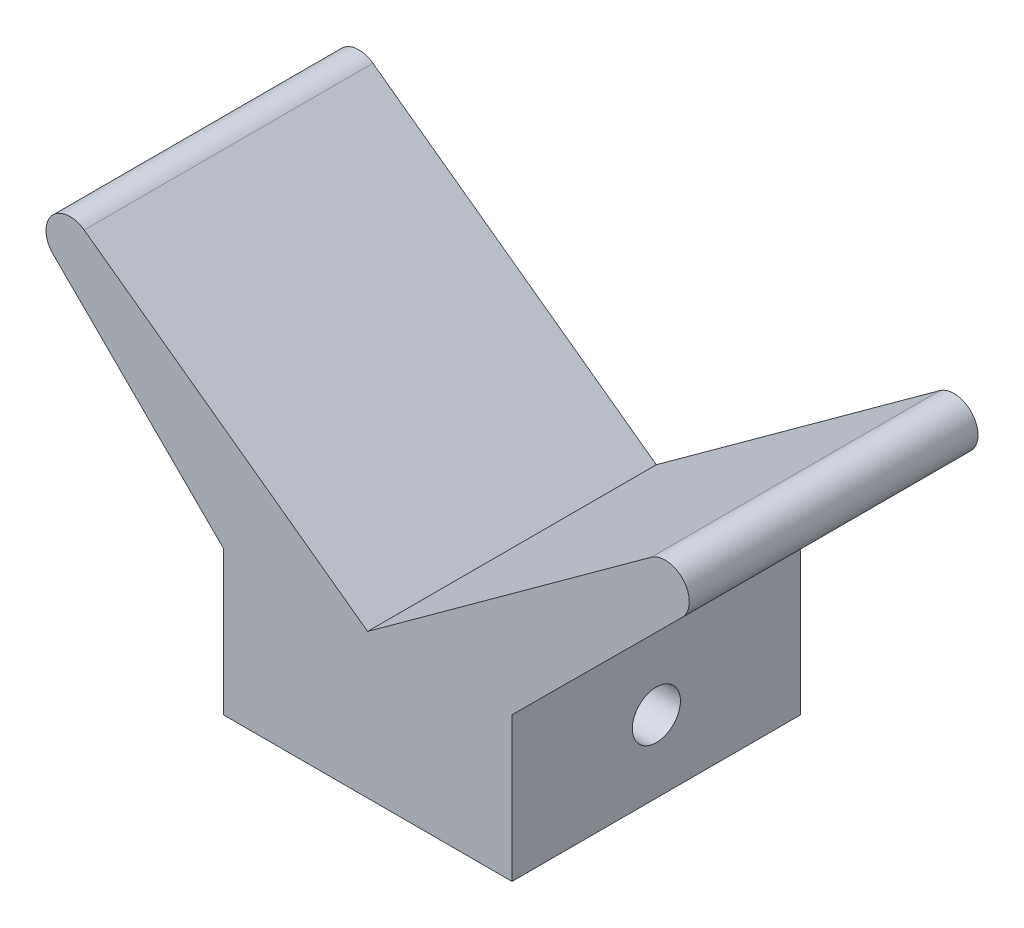
ISO-10303-21;
HEADER;
FILE_DESCRIPTION(('STEP AP214'),'2;1');
FILE_NAME('part.step','',(''),(''),'','','');
FILE_SCHEMA(('AUTOMOTIVE_DESIGN { 1 0 10303 214 1 1 1 1 }'));
ENDSEC;
DATA;
#1=APPLICATION_CONTEXT('core data for automotive mechanical design processes');
#2=APPLICATION_PROTOCOL_DEFINITION('international standard','automotive_design',2000,#1);
#3=PRODUCT_CONTEXT('',#1,'mechanical');
#4=PRODUCT('Part','Part','',(#3));
#5=PRODUCT_RELATED_PRODUCT_CATEGORY('part','',(#4));
#6=PRODUCT_DEFINITION_FORMATION('','',#4);
#7=PRODUCT_DEFINITION_CONTEXT('part definition',#1,'design');
#8=PRODUCT_DEFINITION('design','',#6,#7);
#9=PRODUCT_DEFINITION_SHAPE('','',#8);
#10=(LENGTH_UNIT() NAMED_UNIT(*) SI_UNIT(.MILLI.,.METRE.));
#11=(NAMED_UNIT(*) PLANE_ANGLE_UNIT() SI_UNIT($,.RADIAN.));
#12=(NAMED_UNIT(*) SI_UNIT($,.STERADIAN.) SOLID_ANGLE_UNIT());
#13=UNCERTAINTY_MEASURE_WITH_UNIT(LENGTH_MEASURE(1.E-05),#10,'distance_accuracy_value','');
#14=(GEOMETRIC_REPRESENTATION_CONTEXT(3) GLOBAL_UNCERTAINTY_ASSIGNED_CONTEXT((#13)) GLOBAL_UNIT_ASSIGNED_CONTEXT((#10,
#11,#12)) REPRESENTATION_CONTEXT('',''));
#15=CARTESIAN_POINT('',(0.,0.,0.));
#16=DIRECTION('',(0.,0.,1.));
#17=DIRECTION('',(1.,0.,0.));
#18=AXIS2_PLACEMENT_3D('',#15,#16,#17);
#19=CARTESIAN_POINT('',(38.1,0.,76.2));
#20=DIRECTION('',(-1.,0.,0.));
#21=DIRECTION('',(0.,0.,1.));
#22=AXIS2_PLACEMENT_3D('',#19,#20,#21);
#23=PLANE('',#22);
#24=CARTESIAN_POINT('',(38.1,19.05,38.1));
#25=DIRECTION('',(1.,0.,0.));
#26=DIRECTION('',(0.,0.,-1.));
#27=AXIS2_PLACEMENT_3D('',#24,#25,#26);
#28=CIRCLE('',#27,6.35);
#29=CARTESIAN_POINT('',(38.1,19.05,31.75));
#30=VERTEX_POINT('',#29);
#31=EDGE_CURVE('E198',#30,#30,#28,.T.);
#32=ORIENTED_EDGE('',*,*,#31,.F.);
#33=EDGE_LOOP('',(#32));
#34=FACE_BOUND('',#33,.T.);
#35=DIRECTION('',(0.,1.,0.));
#36=VECTOR('',#35,1.);
#37=CARTESIAN_POINT('',(38.1,0.,0.));
#38=LINE('',#37,#36);
#39=CARTESIAN_POINT('',(38.1,0.,0.));
#40=VERTEX_POINT('',#39);
#41=CARTESIAN_POINT('',(38.1,38.1,0.));
#42=VERTEX_POINT('',#41);
#43=EDGE_CURVE('E140',#40,#42,#38,.T.);
#44=ORIENTED_EDGE('',*,*,#43,.T.);
#45=DIRECTION('',(0.,0.,-1.));
#46=VECTOR('',#45,1.);
#47=CARTESIAN_POINT('',(38.1,38.1,76.2));
#48=LINE('',#47,#46);
#49=CARTESIAN_POINT('',(38.1,38.1,76.2));
#50=VERTEX_POINT('',#49);
#51=EDGE_CURVE('E11',#50,#42,#48,.T.);
#52=ORIENTED_EDGE('',*,*,#51,.F.);
#53=DIRECTION('',(0.,1.,0.));
#54=VECTOR('',#53,1.);
#55=CARTESIAN_POINT('',(38.1,0.,76.2));
#56=LINE('',#55,#54);
#57=CARTESIAN_POINT('',(38.1,0.,76.2));
#58=VERTEX_POINT('',#57);
#59=EDGE_CURVE('E156',#58,#50,#56,.T.);
#60=ORIENTED_EDGE('',*,*,#59,.F.);
#61=DIRECTION('',(0.,0.,-1.));
#62=VECTOR('',#61,1.);
#63=CARTESIAN_POINT('',(38.1,0.,76.2));
#64=LINE('',#63,#62);
#65=EDGE_CURVE('E136',#58,#40,#64,.T.);
#66=ORIENTED_EDGE('',*,*,#65,.T.);
#67=EDGE_LOOP('',(#44,#52,#60,#66));
#68=FACE_BOUND('',#67,.T.);
#69=ADVANCED_FACE('F37',(#34,#68),#23,.F.);
#70=CARTESIAN_POINT('',(38.1,38.1,76.2));
#71=DIRECTION('',(-0.705478228073371,0.708731592152105,0.));
#72=DIRECTION('',(-0.708731592152105,-0.705478228073371,0.));
#73=AXIS2_PLACEMENT_3D('',#70,#71,#72);
#74=PLANE('',#73);
#75=DIRECTION('',(0.708731592152105,0.705478228073371,0.));
#76=VECTOR('',#75,1.);
#77=CARTESIAN_POINT('',(38.1,38.1,0.));
#78=LINE('',#77,#76);
#79=CARTESIAN_POINT('',(83.0182472755247,82.8120543898341,0.));
#80=VERTEX_POINT('',#79);
#81=EDGE_CURVE('E143',#42,#80,#78,.T.);
#82=ORIENTED_EDGE('',*,*,#81,.T.);
#83=DIRECTION('',(0.,0.,-1.));
#84=VECTOR('',#83,1.);
#85=CARTESIAN_POINT('',(83.0182472755247,82.8120543898341,76.2));
#86=LINE('',#85,#84);
#87=CARTESIAN_POINT('',(83.0182472755247,82.8120543898341,76.2));
#88=VERTEX_POINT('',#87);
#89=EDGE_CURVE('E46',#88,#80,#86,.T.);
#90=ORIENTED_EDGE('',*,*,#89,.F.);
#91=DIRECTION('',(0.708731592152105,0.705478228073371,0.));
#92=VECTOR('',#91,1.);
#93=CARTESIAN_POINT('',(38.1,38.1,76.2));
#94=LINE('',#93,#92);
#95=EDGE_CURVE('E100',#50,#88,#94,.T.);
#96=ORIENTED_EDGE('',*,*,#95,.F.);
#97=ORIENTED_EDGE('',*,*,#51,.T.);
#98=EDGE_LOOP('',(#82,#90,#96,#97));
#99=FACE_BOUND('',#98,.T.);
#100=ADVANCED_FACE('F215',(#99),#74,.F.);
#101=CARTESIAN_POINT('',(78.5384605272588,87.3125,76.2));
#102=DIRECTION('',(0.,0.,-1.));
#103=DIRECTION('',(-1.,0.,0.));
#104=AXIS2_PLACEMENT_3D('',#101,#102,#103);
#105=CYLINDRICAL_SURFACE('',#104,6.35000000000002);
#106=CARTESIAN_POINT('',(78.5384605272588,87.3125,0.));
#107=DIRECTION('',(0.,0.,1.));
#108=DIRECTION('',(1.,0.,0.));
#109=AXIS2_PLACEMENT_3D('',#106,#107,#108);
#110=CIRCLE('',#109,6.35000000000002);
#111=CARTESIAN_POINT('',(74.8060241752016,92.449757914281,0.));
#112=VERTEX_POINT('',#111);
#113=EDGE_CURVE('E145',#80,#112,#110,.T.);
#114=ORIENTED_EDGE('',*,*,#113,.T.);
#115=DIRECTION('',(0.,0.,-1.));
#116=VECTOR('',#115,1.);
#117=CARTESIAN_POINT('',(74.8060241752016,92.449757914281,76.2));
#118=LINE('',#117,#116);
#119=CARTESIAN_POINT('',(74.8060241752016,92.449757914281,76.2));
#120=VERTEX_POINT('',#119);
#121=EDGE_CURVE('E166',#120,#112,#118,.T.);
#122=ORIENTED_EDGE('',*,*,#121,.F.);
#123=CARTESIAN_POINT('',(78.5384605272588,87.3125,76.2));
#124=DIRECTION('',(0.,0.,1.));
#125=DIRECTION('',(1.,0.,0.));
#126=AXIS2_PLACEMENT_3D('',#123,#124,#125);
#127=CIRCLE('',#126,6.35000000000002);
#128=EDGE_CURVE('E175',#88,#120,#127,.T.);
#129=ORIENTED_EDGE('',*,*,#128,.F.);
#130=ORIENTED_EDGE('',*,*,#89,.T.);
#131=EDGE_LOOP('',(#114,#122,#129,#130));
#132=FACE_BOUND('',#131,.T.);
#133=ADVANCED_FACE('F173',(#132),#105,.T.);
#134=CARTESIAN_POINT('',(74.8060241752016,92.449757914281,76.2));
#135=DIRECTION('',(0.587785252292472,-0.809016994374948,0.));
#136=DIRECTION('',(0.809016994374948,0.587785252292472,0.));
#137=AXIS2_PLACEMENT_3D('',#134,#135,#136);
#138=PLANE('',#137);
#139=DIRECTION('',(-0.809016994374948,-0.587785252292472,0.));
#140=VECTOR('',#139,1.);
#141=CARTESIAN_POINT('',(74.8060241752016,92.449757914281,0.));
#142=LINE('',#141,#140);
#143=CARTESIAN_POINT('',(0.,38.1,0.));
#144=VERTEX_POINT('',#143);
#145=EDGE_CURVE('E147',#112,#144,#142,.T.);
#146=ORIENTED_EDGE('',*,*,#145,.T.);
#147=DIRECTION('',(0.,0.,-1.));
#148=VECTOR('',#147,1.);
#149=CARTESIAN_POINT('',(0.,38.1,76.2));
#150=LINE('',#149,#148);
#151=CARTESIAN_POINT('',(0.,38.1,76.2));
#152=VERTEX_POINT('',#151);
#153=EDGE_CURVE('E163',#152,#144,#150,.T.);
#154=ORIENTED_EDGE('',*,*,#153,.F.);
#155=DIRECTION('',(-0.809016994374948,-0.587785252292472,0.));
#156=VECTOR('',#155,1.);
#157=CARTESIAN_POINT('',(74.8060241752016,92.449757914281,76.2));
#158=LINE('',#157,#156);
#159=EDGE_CURVE('E191',#120,#152,#158,.T.);
#160=ORIENTED_EDGE('',*,*,#159,.F.);
#161=ORIENTED_EDGE('',*,*,#121,.T.);
#162=EDGE_LOOP('',(#146,#154,#160,#161));
#163=FACE_BOUND('',#162,.T.);
#164=ADVANCED_FACE('F184',(#163),#138,.F.);
#165=CARTESIAN_POINT('',(-74.8060241752016,92.449757914281,76.2));
#166=DIRECTION('',(-0.587785252292472,-0.809016994374948,0.));
#167=DIRECTION('',(0.809016994374948,-0.587785252292472,0.));
#168=AXIS2_PLACEMENT_3D('',#165,#166,#167);
#169=PLANE('',#168);
#170=DIRECTION('',(-0.809016994374948,0.587785252292472,0.));
#171=VECTOR('',#170,1.);
#172=CARTESIAN_POINT('',(-74.8060241752016,92.449757914281,0.));
#173=LINE('',#172,#171);
#174=CARTESIAN_POINT('',(-74.8060241752016,92.4497579142809,0.));
#175=VERTEX_POINT('',#174);
#176=EDGE_CURVE('E149',#144,#175,#173,.T.);
#177=ORIENTED_EDGE('',*,*,#176,.T.);
#178=DIRECTION('',(0.,0.,-1.));
#179=VECTOR('',#178,1.);
#180=CARTESIAN_POINT('',(-74.8060241752016,92.4497579142809,76.2));
#181=LINE('',#180,#179);
#182=CARTESIAN_POINT('',(-74.8060241752016,92.4497579142809,76.2));
#183=VERTEX_POINT('',#182);
#184=EDGE_CURVE('E160',#183,#175,#181,.T.);
#185=ORIENTED_EDGE('',*,*,#184,.F.);
#186=DIRECTION('',(-0.809016994374948,0.587785252292472,0.));
#187=VECTOR('',#186,1.);
#188=CARTESIAN_POINT('',(-74.8060241752016,92.449757914281,76.2));
#189=LINE('',#188,#187);
#190=EDGE_CURVE('E190',#152,#183,#189,.T.);
#191=ORIENTED_EDGE('',*,*,#190,.F.);
#192=ORIENTED_EDGE('',*,*,#153,.T.);
#193=EDGE_LOOP('',(#177,#185,#191,#192));
#194=FACE_BOUND('',#193,.T.);
#195=ADVANCED_FACE('F188',(#194),#169,.F.);
#196=CARTESIAN_POINT('',(-78.5384605272588,87.3125,76.2));
#197=DIRECTION('',(0.,0.,-1.));
#198=DIRECTION('',(-1.,0.,0.));
#199=AXIS2_PLACEMENT_3D('',#196,#197,#198);
#200=CYLINDRICAL_SURFACE('',#199,6.35000000000002);
#201=CARTESIAN_POINT('',(-78.5384605272588,87.3125,0.));
#202=DIRECTION('',(0.,0.,1.));
#203=DIRECTION('',(-1.,0.,0.));
#204=AXIS2_PLACEMENT_3D('',#201,#202,#203);
#205=CIRCLE('',#204,6.35000000000002);
#206=CARTESIAN_POINT('',(-83.0182472755247,82.8120543898341,0.));
#207=VERTEX_POINT('',#206);
#208=EDGE_CURVE('E151',#175,#207,#205,.T.);
#209=ORIENTED_EDGE('',*,*,#208,.T.);
#210=DIRECTION('',(0.,0.,-1.));
#211=VECTOR('',#210,1.);
#212=CARTESIAN_POINT('',(-83.0182472755247,82.8120543898341,76.2));
#213=LINE('',#212,#211);
#214=CARTESIAN_POINT('',(-83.0182472755247,82.8120543898341,76.2));
#215=VERTEX_POINT('',#214);
#216=EDGE_CURVE('E131',#215,#207,#213,.T.);
#217=ORIENTED_EDGE('',*,*,#216,.F.);
#218=CARTESIAN_POINT('',(-78.5384605272588,87.3125,76.2));
#219=DIRECTION('',(0.,0.,1.));
#220=DIRECTION('',(-1.,0.,0.));
#221=AXIS2_PLACEMENT_3D('',#218,#219,#220);
#222=CIRCLE('',#221,6.35000000000002);
#223=EDGE_CURVE('E122',#183,#215,#222,.T.);
#224=ORIENTED_EDGE('',*,*,#223,.F.);
#225=ORIENTED_EDGE('',*,*,#184,.T.);
#226=EDGE_LOOP('',(#209,#217,#224,#225));
#227=FACE_BOUND('',#226,.T.);
#228=ADVANCED_FACE('F224',(#227),#200,.T.);
#229=CARTESIAN_POINT('',(-38.1,38.1,76.2));
#230=DIRECTION('',(0.705478228073371,0.708731592152105,0.));
#231=DIRECTION('',(-0.708731592152105,0.705478228073371,0.));
#232=AXIS2_PLACEMENT_3D('',#229,#230,#231);
#233=PLANE('',#232);
#234=DIRECTION('',(0.708731592152105,-0.705478228073371,0.));
#235=VECTOR('',#234,1.);
#236=CARTESIAN_POINT('',(-38.1,38.1,0.));
#237=LINE('',#236,#235);
#238=CARTESIAN_POINT('',(-38.1,38.1,0.));
#239=VERTEX_POINT('',#238);
#240=EDGE_CURVE('E130',#207,#239,#237,.T.);
#241=ORIENTED_EDGE('',*,*,#240,.T.);
#242=DIRECTION('',(0.,0.,-1.));
#243=VECTOR('',#242,1.);
#244=CARTESIAN_POINT('',(-38.1,38.1,76.2));
#245=LINE('',#244,#243);
#246=CARTESIAN_POINT('',(-38.1,38.1,76.2));
#247=VERTEX_POINT('',#246);
#248=EDGE_CURVE('E127',#247,#239,#245,.T.);
#249=ORIENTED_EDGE('',*,*,#248,.F.);
#250=DIRECTION('',(0.708731592152105,-0.705478228073371,0.));
#251=VECTOR('',#250,1.);
#252=CARTESIAN_POINT('',(-38.1,38.1,76.2));
#253=LINE('',#252,#251);
#254=EDGE_CURVE('E116',#215,#247,#253,.T.);
#255=ORIENTED_EDGE('',*,*,#254,.F.);
#256=ORIENTED_EDGE('',*,*,#216,.T.);
#257=EDGE_LOOP('',(#241,#249,#255,#256));
#258=FACE_BOUND('',#257,.T.);
#259=ADVANCED_FACE('F128',(#258),#233,.F.);
#260=CARTESIAN_POINT('',(-38.1,0.,76.2));
#261=DIRECTION('',(1.,0.,0.));
#262=DIRECTION('',(0.,0.,-1.));
#263=AXIS2_PLACEMENT_3D('',#260,#261,#262);
#264=PLANE('',#263);
#265=CARTESIAN_POINT('',(-38.1,19.05,38.1));
#266=DIRECTION('',(1.,0.,0.));
#267=DIRECTION('',(0.,0.,-1.));
#268=AXIS2_PLACEMENT_3D('',#265,#266,#267);
#269=CIRCLE('',#268,6.35);
#270=CARTESIAN_POINT('',(-38.1,19.05,31.75));
#271=VERTEX_POINT('',#270);
#272=EDGE_CURVE('E40',#271,#271,#269,.T.);
#273=ORIENTED_EDGE('',*,*,#272,.T.);
#274=EDGE_LOOP('',(#273));
#275=FACE_BOUND('',#274,.T.);
#276=DIRECTION('',(0.,-1.,0.));
#277=VECTOR('',#276,1.);
#278=CARTESIAN_POINT('',(-38.1,0.,0.));
#279=LINE('',#278,#277);
#280=CARTESIAN_POINT('',(-38.1,0.,0.));
#281=VERTEX_POINT('',#280);
#282=EDGE_CURVE('E86',#239,#281,#279,.T.);
#283=ORIENTED_EDGE('',*,*,#282,.T.);
#284=DIRECTION('',(0.,0.,-1.));
#285=VECTOR('',#284,1.);
#286=CARTESIAN_POINT('',(-38.1,0.,76.2));
#287=LINE('',#286,#285);
#288=CARTESIAN_POINT('',(-38.1,0.,76.2));
#289=VERTEX_POINT('',#288);
#290=EDGE_CURVE('E132',#289,#281,#287,.T.);
#291=ORIENTED_EDGE('',*,*,#290,.F.);
#292=DIRECTION('',(0.,-1.,0.));
#293=VECTOR('',#292,1.);
#294=CARTESIAN_POINT('',(-38.1,0.,76.2));
#295=LINE('',#294,#293);
#296=EDGE_CURVE('E120',#247,#289,#295,.T.);
#297=ORIENTED_EDGE('',*,*,#296,.F.);
#298=ORIENTED_EDGE('',*,*,#248,.T.);
#299=EDGE_LOOP('',(#283,#291,#297,#298));
#300=FACE_BOUND('',#299,.T.);
#301=ADVANCED_FACE('F134',(#275,#300),#264,.F.);
#302=CARTESIAN_POINT('',(-38.1,0.,76.2));
#303=DIRECTION('',(0.,1.,0.));
#304=DIRECTION('',(-1.,0.,0.));
#305=AXIS2_PLACEMENT_3D('',#302,#303,#304);
#306=PLANE('',#305);
#307=DIRECTION('',(1.,0.,0.));
#308=VECTOR('',#307,1.);
#309=CARTESIAN_POINT('',(-38.1,0.,0.));
#310=LINE('',#309,#308);
#311=EDGE_CURVE('E92',#281,#40,#310,.T.);
#312=ORIENTED_EDGE('',*,*,#311,.T.);
#313=ORIENTED_EDGE('',*,*,#65,.F.);
#314=DIRECTION('',(1.,0.,0.));
#315=VECTOR('',#314,1.);
#316=CARTESIAN_POINT('',(-38.1,0.,76.2));
#317=LINE('',#316,#315);
#318=EDGE_CURVE('E54',#289,#58,#317,.T.);
#319=ORIENTED_EDGE('',*,*,#318,.F.);
#320=ORIENTED_EDGE('',*,*,#290,.T.);
#321=EDGE_LOOP('',(#312,#313,#319,#320));
#322=FACE_BOUND('',#321,.T.);
#323=ADVANCED_FACE('F267',(#322),#306,.F.);
#324=CARTESIAN_POINT('',(78.5384605272588,87.3125,76.2));
#325=DIRECTION('',(0.,0.,1.));
#326=DIRECTION('',(1.,0.,0.));
#327=AXIS2_PLACEMENT_3D('',#324,#325,#326);
#328=PLANE('',#327);
#329=ORIENTED_EDGE('',*,*,#59,.T.);
#330=ORIENTED_EDGE('',*,*,#95,.T.);
#331=ORIENTED_EDGE('',*,*,#128,.T.);
#332=ORIENTED_EDGE('',*,*,#159,.T.);
#333=ORIENTED_EDGE('',*,*,#190,.T.);
#334=ORIENTED_EDGE('',*,*,#223,.T.);
#335=ORIENTED_EDGE('',*,*,#254,.T.);
#336=ORIENTED_EDGE('',*,*,#296,.T.);
#337=ORIENTED_EDGE('',*,*,#318,.T.);
#338=EDGE_LOOP('',(#329,#330,#331,#332,#333,#334,#335,#336,#337));
#339=FACE_BOUND('',#338,.T.);
#340=ADVANCED_FACE('F118',(#339),#328,.T.);
#341=CARTESIAN_POINT('',(78.5384605272588,87.3125,0.));
#342=DIRECTION('',(0.,0.,1.));
#343=DIRECTION('',(1.,0.,0.));
#344=AXIS2_PLACEMENT_3D('',#341,#342,#343);
#345=PLANE('',#344);
#346=ORIENTED_EDGE('',*,*,#43,.F.);
#347=ORIENTED_EDGE('',*,*,#311,.F.);
#348=ORIENTED_EDGE('',*,*,#282,.F.);
#349=ORIENTED_EDGE('',*,*,#240,.F.);
#350=ORIENTED_EDGE('',*,*,#208,.F.);
#351=ORIENTED_EDGE('',*,*,#176,.F.);
#352=ORIENTED_EDGE('',*,*,#145,.F.);
#353=ORIENTED_EDGE('',*,*,#113,.F.);
#354=ORIENTED_EDGE('',*,*,#81,.F.);
#355=EDGE_LOOP('',(#346,#347,#348,#349,#350,#351,#352,#353,#354));
#356=FACE_BOUND('',#355,.T.);
#357=ADVANCED_FACE('F179',(#356),#345,.F.);
#358=CARTESIAN_POINT('',(-84.8884605272588,19.05,38.1));
#359=DIRECTION('',(1.,0.,0.));
#360=DIRECTION('',(0.,0.,-1.));
#361=AXIS2_PLACEMENT_3D('',#358,#359,#360);
#362=CYLINDRICAL_SURFACE('',#361,6.35);
#363=ORIENTED_EDGE('',*,*,#31,.T.);
#364=EDGE_LOOP('',(#363));
#365=FACE_BOUND('',#364,.T.);
#366=ORIENTED_EDGE('',*,*,#272,.F.);
#367=EDGE_LOOP('',(#366));
#368=FACE_BOUND('',#367,.T.);
#369=ADVANCED_FACE('F206',(#365,#368),#362,.F.);
#370=CLOSED_SHELL('',(#69,#100,#133,#164,#195,#228,#259,#301,#323,#340,#357,#369));
#371=MANIFOLD_SOLID_BREP('B2',#370);
#372=ADVANCED_BREP_SHAPE_REPRESENTATION('',(#18,#371),#14);
#373=SHAPE_DEFINITION_REPRESENTATION(#9,#372);
ENDSEC;
END-ISO-10303-21;
